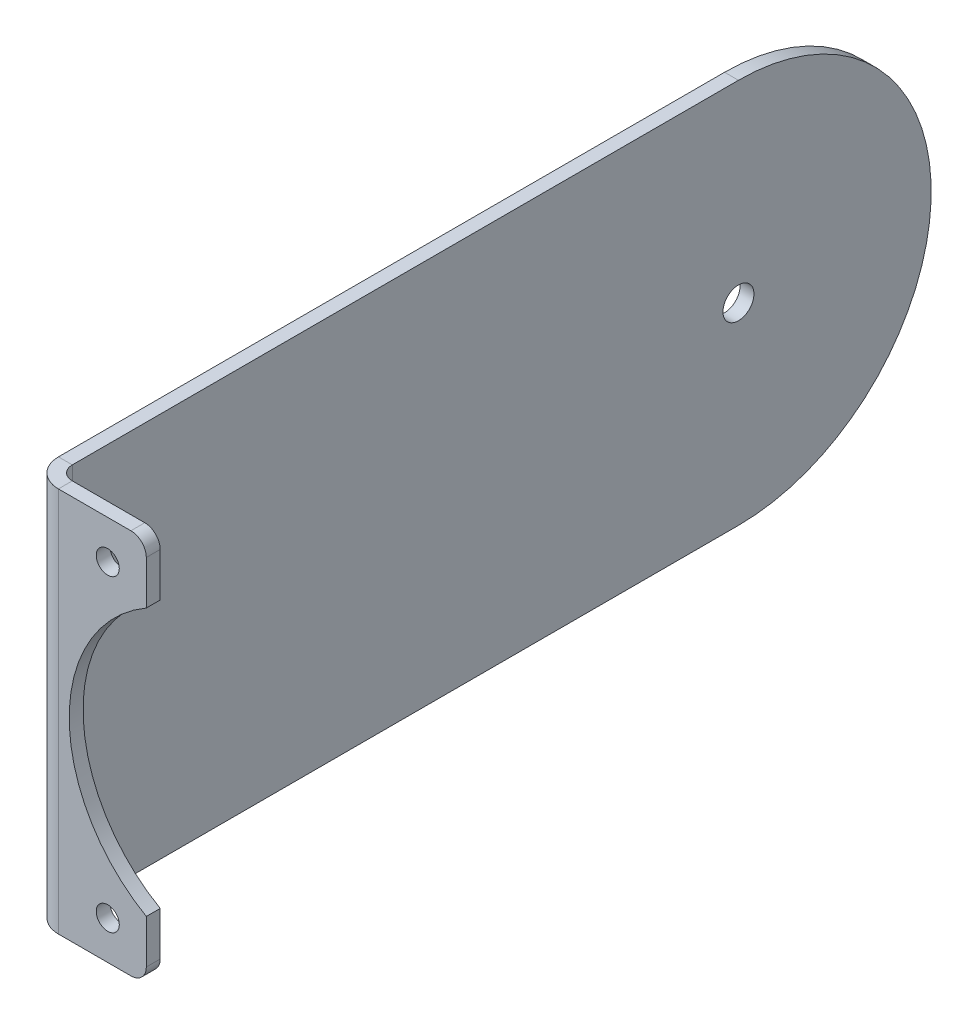
ISO-10303-21;
HEADER;
FILE_DESCRIPTION(('STEP AP214'),'2;1');
FILE_NAME('part.step','',(''),(''),'','','');
FILE_SCHEMA(('AUTOMOTIVE_DESIGN { 1 0 10303 214 1 1 1 1 }'));
ENDSEC;
DATA;
#1=APPLICATION_CONTEXT('core data for automotive mechanical design processes');
#2=APPLICATION_PROTOCOL_DEFINITION('international standard','automotive_design',2000,#1);
#3=PRODUCT_CONTEXT('',#1,'mechanical');
#4=PRODUCT('Part','Part','',(#3));
#5=PRODUCT_RELATED_PRODUCT_CATEGORY('part','',(#4));
#6=PRODUCT_DEFINITION_FORMATION('','',#4);
#7=PRODUCT_DEFINITION_CONTEXT('part definition',#1,'design');
#8=PRODUCT_DEFINITION('design','',#6,#7);
#9=PRODUCT_DEFINITION_SHAPE('','',#8);
#10=(LENGTH_UNIT() NAMED_UNIT(*) SI_UNIT(.MILLI.,.METRE.));
#11=(NAMED_UNIT(*) PLANE_ANGLE_UNIT() SI_UNIT($,.RADIAN.));
#12=(NAMED_UNIT(*) SI_UNIT($,.STERADIAN.) SOLID_ANGLE_UNIT());
#13=UNCERTAINTY_MEASURE_WITH_UNIT(LENGTH_MEASURE(1.E-05),#10,'distance_accuracy_value','');
#14=(GEOMETRIC_REPRESENTATION_CONTEXT(3) GLOBAL_UNCERTAINTY_ASSIGNED_CONTEXT((#13)) GLOBAL_UNIT_ASSIGNED_CONTEXT((#10,
#11,#12)) REPRESENTATION_CONTEXT('',''));
#15=CARTESIAN_POINT('',(0.,0.,0.));
#16=DIRECTION('',(0.,0.,1.));
#17=DIRECTION('',(1.,0.,0.));
#18=AXIS2_PLACEMENT_3D('',#15,#16,#17);
#19=CARTESIAN_POINT('',(-7.23900000000001,31.75,-73.025));
#20=DIRECTION('',(1.,0.,0.));
#21=DIRECTION('',(0.,0.,-1.));
#22=AXIS2_PLACEMENT_3D('',#19,#20,#21);
#23=PLANE('',#22);
#24=CARTESIAN_POINT('',(-7.23900000000001,0.,-41.275));
#25=DIRECTION('',(1.,0.,0.));
#26=DIRECTION('',(0.,0.,-1.));
#27=AXIS2_PLACEMENT_3D('',#24,#25,#26);
#28=CIRCLE('',#27,2.5527);
#29=CARTESIAN_POINT('',(-7.23900000000001,0.,-43.8277));
#30=VERTEX_POINT('',#29);
#31=EDGE_CURVE('E148',#30,#30,#28,.T.);
#32=ORIENTED_EDGE('',*,*,#31,.F.);
#33=EDGE_LOOP('',(#32));
#34=FACE_BOUND('',#33,.T.);
#35=DIRECTION('',(0.,0.,1.));
#36=VECTOR('',#35,1.);
#37=CARTESIAN_POINT('',(-7.23900000000001,-31.75,-73.025));
#38=LINE('',#37,#36);
#39=CARTESIAN_POINT('',(-7.23900000000001,-31.75,-41.275));
#40=VERTEX_POINT('',#39);
#41=CARTESIAN_POINT('',(-7.23900000000001,-31.75,68.453));
#42=VERTEX_POINT('',#41);
#43=EDGE_CURVE('E155',#40,#42,#38,.T.);
#44=ORIENTED_EDGE('',*,*,#43,.F.);
#45=CARTESIAN_POINT('',(-7.23900000000001,0.,-41.275));
#46=DIRECTION('',(1.,0.,0.));
#47=DIRECTION('',(0.,0.,-1.));
#48=AXIS2_PLACEMENT_3D('',#45,#46,#47);
#49=CIRCLE('',#48,31.75);
#50=CARTESIAN_POINT('',(-7.23900000000001,31.75,-41.275));
#51=VERTEX_POINT('',#50);
#52=EDGE_CURVE('E61',#51,#40,#49,.F.);
#53=ORIENTED_EDGE('',*,*,#52,.F.);
#54=DIRECTION('',(0.,0.,1.));
#55=VECTOR('',#54,1.);
#56=CARTESIAN_POINT('',(-7.23900000000001,31.75,-73.025));
#57=LINE('',#56,#55);
#58=CARTESIAN_POINT('',(-7.23900000000001,31.75,68.453));
#59=VERTEX_POINT('',#58);
#60=EDGE_CURVE('E244',#51,#59,#57,.T.);
#61=ORIENTED_EDGE('',*,*,#60,.T.);
#62=DIRECTION('',(0.,-1.,0.));
#63=VECTOR('',#62,1.);
#64=CARTESIAN_POINT('',(-7.23900000000001,31.75,68.453));
#65=LINE('',#64,#63);
#66=EDGE_CURVE('E170',#59,#42,#65,.T.);
#67=ORIENTED_EDGE('',*,*,#66,.T.);
#68=EDGE_LOOP('',(#44,#53,#61,#67));
#69=FACE_BOUND('',#68,.T.);
#70=ADVANCED_FACE('F44',(#34,#69),#23,.T.);
#71=CARTESIAN_POINT('',(-9.52500000000001,31.75,-73.025));
#72=DIRECTION('',(1.,0.,0.));
#73=DIRECTION('',(0.,0.,-1.));
#74=AXIS2_PLACEMENT_3D('',#71,#72,#73);
#75=PLANE('',#74);
#76=CARTESIAN_POINT('',(-9.52500000000001,0.,-41.275));
#77=DIRECTION('',(-1.,0.,0.));
#78=DIRECTION('',(0.,0.,1.));
#79=AXIS2_PLACEMENT_3D('',#76,#77,#78);
#80=CIRCLE('',#79,2.5527);
#81=CARTESIAN_POINT('',(-9.52500000000001,0.,-38.7223));
#82=VERTEX_POINT('',#81);
#83=EDGE_CURVE('E210',#82,#82,#80,.T.);
#84=ORIENTED_EDGE('',*,*,#83,.F.);
#85=EDGE_LOOP('',(#84));
#86=FACE_BOUND('',#85,.T.);
#87=DIRECTION('',(0.,0.,1.));
#88=VECTOR('',#87,1.);
#89=CARTESIAN_POINT('',(-9.52500000000001,31.75,-73.025));
#90=LINE('',#89,#88);
#91=CARTESIAN_POINT('',(-9.52500000000001,31.75,-41.275));
#92=VERTEX_POINT('',#91);
#93=CARTESIAN_POINT('',(-9.52500000000001,31.75,68.453));
#94=VERTEX_POINT('',#93);
#95=EDGE_CURVE('E146',#92,#94,#90,.T.);
#96=ORIENTED_EDGE('',*,*,#95,.F.);
#97=CARTESIAN_POINT('',(-9.52500000000001,0.,-41.275));
#98=DIRECTION('',(1.,0.,0.));
#99=DIRECTION('',(0.,0.,1.));
#100=AXIS2_PLACEMENT_3D('',#97,#98,#99);
#101=CIRCLE('',#100,31.75);
#102=CARTESIAN_POINT('',(-9.52500000000001,-31.75,-41.275));
#103=VERTEX_POINT('',#102);
#104=EDGE_CURVE('E135',#103,#92,#101,.T.);
#105=ORIENTED_EDGE('',*,*,#104,.F.);
#106=DIRECTION('',(0.,0.,1.));
#107=VECTOR('',#106,1.);
#108=CARTESIAN_POINT('',(-9.52500000000001,-31.75,-73.025));
#109=LINE('',#108,#107);
#110=CARTESIAN_POINT('',(-9.52500000000001,-31.75,68.453));
#111=VERTEX_POINT('',#110);
#112=EDGE_CURVE('E144',#103,#111,#109,.T.);
#113=ORIENTED_EDGE('',*,*,#112,.T.);
#114=DIRECTION('',(0.,-1.,0.));
#115=VECTOR('',#114,1.);
#116=CARTESIAN_POINT('',(-9.52500000000001,31.75,68.453));
#117=LINE('',#116,#115);
#118=EDGE_CURVE('E167',#94,#111,#117,.T.);
#119=ORIENTED_EDGE('',*,*,#118,.F.);
#120=EDGE_LOOP('',(#96,#105,#113,#119));
#121=FACE_BOUND('',#120,.T.);
#122=ADVANCED_FACE('F142',(#86,#121),#75,.F.);
#123=CARTESIAN_POINT('',(9.525,31.75,70.739));
#124=DIRECTION('',(1.,0.,0.));
#125=DIRECTION('',(0.,0.,-1.));
#126=AXIS2_PLACEMENT_3D('',#123,#124,#125);
#127=PLANE('',#126);
#128=DIRECTION('',(0.,-1.,0.));
#129=VECTOR('',#128,1.);
#130=CARTESIAN_POINT('',(9.525,31.75,70.739));
#131=LINE('',#130,#129);
#132=CARTESIAN_POINT('',(9.525,29.21,70.739));
#133=VERTEX_POINT('',#132);
#134=CARTESIAN_POINT('',(9.525,21.9970452561247,70.739));
#135=VERTEX_POINT('',#134);
#136=EDGE_CURVE('E177',#133,#135,#131,.T.);
#137=ORIENTED_EDGE('',*,*,#136,.F.);
#138=DIRECTION('',(0.,0.,1.));
#139=VECTOR('',#138,1.);
#140=CARTESIAN_POINT('',(9.525,29.21,70.739));
#141=LINE('',#140,#139);
#142=CARTESIAN_POINT('',(9.525,29.21,73.025));
#143=VERTEX_POINT('',#142);
#144=EDGE_CURVE('E193',#133,#143,#141,.T.);
#145=ORIENTED_EDGE('',*,*,#144,.T.);
#146=DIRECTION('',(0.,-1.,0.));
#147=VECTOR('',#146,1.);
#148=CARTESIAN_POINT('',(9.525,31.75,73.025));
#149=LINE('',#148,#147);
#150=CARTESIAN_POINT('',(9.525,21.9970452561247,73.025));
#151=VERTEX_POINT('',#150);
#152=EDGE_CURVE('E180',#143,#151,#149,.T.);
#153=ORIENTED_EDGE('',*,*,#152,.T.);
#154=DIRECTION('',(0.,0.,1.));
#155=VECTOR('',#154,1.);
#156=CARTESIAN_POINT('',(9.525,21.9970452561247,-73.025));
#157=LINE('',#156,#155);
#158=EDGE_CURVE('E232',#135,#151,#157,.T.);
#159=ORIENTED_EDGE('',*,*,#158,.F.);
#160=EDGE_LOOP('',(#137,#145,#153,#159));
#161=FACE_BOUND('',#160,.T.);
#162=ADVANCED_FACE('F288',(#161),#127,.T.);
#163=CARTESIAN_POINT('',(-9.52500000000001,31.75,68.453));
#164=DIRECTION('',(0.,1.,0.));
#165=DIRECTION('',(0.,0.,1.));
#166=AXIS2_PLACEMENT_3D('',#163,#164,#165);
#167=PLANE('',#166);
#168=DIRECTION('',(1.,0.,0.));
#169=VECTOR('',#168,1.);
#170=CARTESIAN_POINT('',(-9.52500000000001,31.75,68.453));
#171=LINE('',#170,#169);
#172=EDGE_CURVE('E187',#94,#59,#171,.T.);
#173=ORIENTED_EDGE('',*,*,#172,.F.);
#174=CARTESIAN_POINT('',(-4.95300000000001,31.75,68.453));
#175=DIRECTION('',(0.,-1.,0.));
#176=DIRECTION('',(0.,0.,-1.));
#177=AXIS2_PLACEMENT_3D('',#174,#175,#176);
#178=CIRCLE('',#177,4.572);
#179=CARTESIAN_POINT('',(-4.95300000000001,31.75,73.025));
#180=VERTEX_POINT('',#179);
#181=EDGE_CURVE('E168',#94,#180,#178,.F.);
#182=ORIENTED_EDGE('',*,*,#181,.T.);
#183=DIRECTION('',(0.,0.,1.));
#184=VECTOR('',#183,1.);
#185=CARTESIAN_POINT('',(-4.95300000000001,31.75,70.739));
#186=LINE('',#185,#184);
#187=CARTESIAN_POINT('',(-4.95300000000001,31.75,70.739));
#188=VERTEX_POINT('',#187);
#189=EDGE_CURVE('E185',#188,#180,#186,.T.);
#190=ORIENTED_EDGE('',*,*,#189,.F.);
#191=CARTESIAN_POINT('',(-4.95300000000001,31.75,68.453));
#192=DIRECTION('',(0.,1.,0.));
#193=DIRECTION('',(-1.,0.,0.));
#194=AXIS2_PLACEMENT_3D('',#191,#192,#193);
#195=CIRCLE('',#194,2.286);
#196=EDGE_CURVE('E241',#59,#188,#195,.T.);
#197=ORIENTED_EDGE('',*,*,#196,.F.);
#198=EDGE_LOOP('',(#173,#182,#190,#197));
#199=FACE_BOUND('',#198,.T.);
#200=ADVANCED_FACE('F299',(#199),#167,.T.);
#201=CARTESIAN_POINT('',(-4.95300000000001,31.75,70.739));
#202=DIRECTION('',(0.,1.,0.));
#203=DIRECTION('',(0.,0.,1.));
#204=AXIS2_PLACEMENT_3D('',#201,#202,#203);
#205=PLANE('',#204);
#206=DIRECTION('',(-1.,0.,0.));
#207=VECTOR('',#206,1.);
#208=CARTESIAN_POINT('',(9.52499999999999,31.75,-41.275));
#209=LINE('',#208,#207);
#210=EDGE_CURVE('E147',#51,#92,#209,.T.);
#211=ORIENTED_EDGE('',*,*,#210,.T.);
#212=ORIENTED_EDGE('',*,*,#95,.T.);
#213=ORIENTED_EDGE('',*,*,#172,.T.);
#214=ORIENTED_EDGE('',*,*,#60,.F.);
#215=EDGE_LOOP('',(#211,#212,#213,#214));
#216=FACE_BOUND('',#215,.T.);
#217=ADVANCED_FACE('F336',(#216),#205,.T.);
#218=CARTESIAN_POINT('',(-4.95300000000001,-31.75,73.025));
#219=DIRECTION('',(0.,-1.,0.));
#220=DIRECTION('',(0.,0.,-1.));
#221=AXIS2_PLACEMENT_3D('',#218,#219,#220);
#222=PLANE('',#221);
#223=DIRECTION('',(0.,0.,-1.));
#224=VECTOR('',#223,1.);
#225=CARTESIAN_POINT('',(-4.95300000000001,-31.75,73.025));
#226=LINE('',#225,#224);
#227=CARTESIAN_POINT('',(-4.95300000000001,-31.75,73.025));
#228=VERTEX_POINT('',#227);
#229=CARTESIAN_POINT('',(-4.95300000000001,-31.75,70.739));
#230=VERTEX_POINT('',#229);
#231=EDGE_CURVE('E183',#228,#230,#226,.T.);
#232=ORIENTED_EDGE('',*,*,#231,.F.);
#233=CARTESIAN_POINT('',(-4.95300000000001,-31.75,68.453));
#234=DIRECTION('',(0.,-1.,0.));
#235=DIRECTION('',(0.,0.,-1.));
#236=AXIS2_PLACEMENT_3D('',#233,#234,#235);
#237=CIRCLE('',#236,4.572);
#238=EDGE_CURVE('E154',#111,#228,#237,.F.);
#239=ORIENTED_EDGE('',*,*,#238,.F.);
#240=DIRECTION('',(-1.,0.,0.));
#241=VECTOR('',#240,1.);
#242=CARTESIAN_POINT('',(-7.23900000000001,-31.75,68.453));
#243=LINE('',#242,#241);
#244=EDGE_CURVE('E152',#42,#111,#243,.T.);
#245=ORIENTED_EDGE('',*,*,#244,.F.);
#246=CARTESIAN_POINT('',(-4.95300000000001,-31.75,68.453));
#247=DIRECTION('',(0.,1.,0.));
#248=DIRECTION('',(-1.,0.,0.));
#249=AXIS2_PLACEMENT_3D('',#246,#247,#248);
#250=CIRCLE('',#249,2.286);
#251=EDGE_CURVE('E160',#42,#230,#250,.T.);
#252=ORIENTED_EDGE('',*,*,#251,.T.);
#253=EDGE_LOOP('',(#232,#239,#245,#252));
#254=FACE_BOUND('',#253,.T.);
#255=ADVANCED_FACE('F255',(#254),#222,.T.);
#256=CARTESIAN_POINT('',(-7.23900000000001,-31.75,68.453));
#257=DIRECTION('',(0.,-1.,0.));
#258=DIRECTION('',(0.,0.,-1.));
#259=AXIS2_PLACEMENT_3D('',#256,#257,#258);
#260=PLANE('',#259);
#261=DIRECTION('',(-1.,0.,0.));
#262=VECTOR('',#261,1.);
#263=CARTESIAN_POINT('',(-9.52500000000001,-31.75,70.739));
#264=LINE('',#263,#262);
#265=CARTESIAN_POINT('',(6.98499999999999,-31.75,70.739));
#266=VERTEX_POINT('',#265);
#267=EDGE_CURVE('E251',#230,#266,#264,.F.);
#268=ORIENTED_EDGE('',*,*,#267,.T.);
#269=DIRECTION('',(0.,0.,1.));
#270=VECTOR('',#269,1.);
#271=CARTESIAN_POINT('',(6.98499999999999,-31.75,68.453));
#272=LINE('',#271,#270);
#273=CARTESIAN_POINT('',(6.98499999999999,-31.75,73.025));
#274=VERTEX_POINT('',#273);
#275=EDGE_CURVE('E205',#266,#274,#272,.T.);
#276=ORIENTED_EDGE('',*,*,#275,.T.);
#277=DIRECTION('',(1.,0.,0.));
#278=VECTOR('',#277,1.);
#279=CARTESIAN_POINT('',(-9.52500000000001,-31.75,73.025));
#280=LINE('',#279,#278);
#281=EDGE_CURVE('E235',#228,#274,#280,.T.);
#282=ORIENTED_EDGE('',*,*,#281,.F.);
#283=ORIENTED_EDGE('',*,*,#231,.T.);
#284=EDGE_LOOP('',(#268,#276,#282,#283));
#285=FACE_BOUND('',#284,.T.);
#286=ADVANCED_FACE('F266',(#285),#260,.T.);
#287=CARTESIAN_POINT('',(-9.52500000000001,31.75,73.025));
#288=DIRECTION('',(0.,0.,-1.));
#289=DIRECTION('',(-1.,0.,0.));
#290=AXIS2_PLACEMENT_3D('',#287,#288,#289);
#291=PLANE('',#290);
#292=CARTESIAN_POINT('',(3.17499999999999,25.4,73.025));
#293=DIRECTION('',(0.,0.,1.));
#294=DIRECTION('',(1.,0.,0.));
#295=AXIS2_PLACEMENT_3D('',#292,#293,#294);
#296=CIRCLE('',#295,1.89865);
#297=CARTESIAN_POINT('',(5.07364999999999,25.4,73.025));
#298=VERTEX_POINT('',#297);
#299=EDGE_CURVE('E221',#298,#298,#296,.T.);
#300=ORIENTED_EDGE('',*,*,#299,.F.);
#301=EDGE_LOOP('',(#300));
#302=FACE_BOUND('',#301,.T.);
#303=CARTESIAN_POINT('',(3.17499999999999,-25.4,73.025));
#304=DIRECTION('',(0.,0.,1.));
#305=DIRECTION('',(1.,0.,0.));
#306=AXIS2_PLACEMENT_3D('',#303,#304,#305);
#307=CIRCLE('',#306,1.89865);
#308=CARTESIAN_POINT('',(5.07364999999999,-25.4,73.025));
#309=VERTEX_POINT('',#308);
#310=EDGE_CURVE('E211',#309,#309,#307,.T.);
#311=ORIENTED_EDGE('',*,*,#310,.F.);
#312=EDGE_LOOP('',(#311));
#313=FACE_BOUND('',#312,.T.);
#314=ORIENTED_EDGE('',*,*,#152,.F.);
#315=CARTESIAN_POINT('',(6.98499999999999,29.21,73.025));
#316=DIRECTION('',(0.,0.,-1.));
#317=DIRECTION('',(-1.,0.,0.));
#318=AXIS2_PLACEMENT_3D('',#315,#316,#317);
#319=CIRCLE('',#318,2.54);
#320=CARTESIAN_POINT('',(6.98499999999999,31.75,73.025));
#321=VERTEX_POINT('',#320);
#322=EDGE_CURVE('E198',#143,#321,#319,.F.);
#323=ORIENTED_EDGE('',*,*,#322,.T.);
#324=DIRECTION('',(1.,0.,0.));
#325=VECTOR('',#324,1.);
#326=CARTESIAN_POINT('',(-9.52500000000001,31.75,73.025));
#327=LINE('',#326,#325);
#328=EDGE_CURVE('E158',#180,#321,#327,.T.);
#329=ORIENTED_EDGE('',*,*,#328,.F.);
#330=DIRECTION('',(0.,-1.,0.));
#331=VECTOR('',#330,1.);
#332=CARTESIAN_POINT('',(-4.95300000000001,31.75,73.025));
#333=LINE('',#332,#331);
#334=EDGE_CURVE('E164',#180,#228,#333,.T.);
#335=ORIENTED_EDGE('',*,*,#334,.T.);
#336=ORIENTED_EDGE('',*,*,#281,.T.);
#337=CARTESIAN_POINT('',(6.98499999999999,-29.21,73.025));
#338=DIRECTION('',(0.,0.,-1.));
#339=DIRECTION('',(-1.,0.,0.));
#340=AXIS2_PLACEMENT_3D('',#337,#338,#339);
#341=CIRCLE('',#340,2.54);
#342=CARTESIAN_POINT('',(9.525,-29.21,73.025));
#343=VERTEX_POINT('',#342);
#344=EDGE_CURVE('E196',#274,#343,#341,.F.);
#345=ORIENTED_EDGE('',*,*,#344,.T.);
#346=CARTESIAN_POINT('',(9.525,-21.9970452561247,73.025));
#347=VERTEX_POINT('',#346);
#348=EDGE_CURVE('E179',#347,#343,#149,.T.);
#349=ORIENTED_EDGE('',*,*,#348,.F.);
#350=CARTESIAN_POINT('',(22.225,0.,73.025));
#351=DIRECTION('',(0.,0.,1.));
#352=DIRECTION('',(1.,0.,0.));
#353=AXIS2_PLACEMENT_3D('',#350,#351,#352);
#354=CIRCLE('',#353,25.4);
#355=EDGE_CURVE('E228',#151,#347,#354,.T.);
#356=ORIENTED_EDGE('',*,*,#355,.F.);
#357=EDGE_LOOP('',(#314,#323,#329,#335,#336,#345,#349,#356));
#358=FACE_BOUND('',#357,.T.);
#359=ADVANCED_FACE('F274',(#302,#313,#358),#291,.F.);
#360=ORIENTED_EDGE('',*,*,#348,.T.);
#361=DIRECTION('',(0.,0.,1.));
#362=VECTOR('',#361,1.);
#363=CARTESIAN_POINT('',(9.525,-29.21,70.739));
#364=LINE('',#363,#362);
#365=CARTESIAN_POINT('',(9.525,-29.21,70.739));
#366=VERTEX_POINT('',#365);
#367=EDGE_CURVE('E53',#343,#366,#364,.F.);
#368=ORIENTED_EDGE('',*,*,#367,.T.);
#369=CARTESIAN_POINT('',(9.525,-21.9970452561247,70.739));
#370=VERTEX_POINT('',#369);
#371=EDGE_CURVE('E176',#370,#366,#131,.T.);
#372=ORIENTED_EDGE('',*,*,#371,.F.);
#373=DIRECTION('',(0.,0.,1.));
#374=VECTOR('',#373,1.);
#375=CARTESIAN_POINT('',(9.525,-21.9970452561247,-73.025));
#376=LINE('',#375,#374);
#377=EDGE_CURVE('E230',#347,#370,#376,.F.);
#378=ORIENTED_EDGE('',*,*,#377,.F.);
#379=EDGE_LOOP('',(#360,#368,#372,#378));
#380=FACE_BOUND('',#379,.T.);
#381=ADVANCED_FACE('F278',(#380),#127,.T.);
#382=CARTESIAN_POINT('',(-9.52500000000001,31.75,70.739));
#383=DIRECTION('',(0.,0.,-1.));
#384=DIRECTION('',(-1.,0.,0.));
#385=AXIS2_PLACEMENT_3D('',#382,#383,#384);
#386=PLANE('',#385);
#387=CARTESIAN_POINT('',(3.17499999999999,25.4,70.739));
#388=DIRECTION('',(0.,0.,-1.));
#389=DIRECTION('',(-1.,0.,0.));
#390=AXIS2_PLACEMENT_3D('',#387,#388,#389);
#391=CIRCLE('',#390,1.89864999999998);
#392=CARTESIAN_POINT('',(1.27635000000001,25.4,70.739));
#393=VERTEX_POINT('',#392);
#394=EDGE_CURVE('E48',#393,#393,#391,.T.);
#395=ORIENTED_EDGE('',*,*,#394,.F.);
#396=EDGE_LOOP('',(#395));
#397=FACE_BOUND('',#396,.T.);
#398=CARTESIAN_POINT('',(3.17499999999999,-25.4,70.739));
#399=DIRECTION('',(0.,0.,-1.));
#400=DIRECTION('',(-1.,0.,0.));
#401=AXIS2_PLACEMENT_3D('',#398,#399,#400);
#402=CIRCLE('',#401,1.89864999999998);
#403=CARTESIAN_POINT('',(1.27635000000001,-25.4,70.739));
#404=VERTEX_POINT('',#403);
#405=EDGE_CURVE('E208',#404,#404,#402,.T.);
#406=ORIENTED_EDGE('',*,*,#405,.F.);
#407=EDGE_LOOP('',(#406));
#408=FACE_BOUND('',#407,.T.);
#409=DIRECTION('',(-1.,0.,0.));
#410=VECTOR('',#409,1.);
#411=CARTESIAN_POINT('',(-9.52500000000001,31.75,70.739));
#412=LINE('',#411,#410);
#413=CARTESIAN_POINT('',(6.98499999999999,31.75,70.739));
#414=VERTEX_POINT('',#413);
#415=EDGE_CURVE('E238',#188,#414,#412,.F.);
#416=ORIENTED_EDGE('',*,*,#415,.T.);
#417=CARTESIAN_POINT('',(6.98499999999999,29.21,70.739));
#418=DIRECTION('',(0.,0.,-1.));
#419=DIRECTION('',(-1.,0.,0.));
#420=AXIS2_PLACEMENT_3D('',#417,#418,#419);
#421=CIRCLE('',#420,2.54);
#422=EDGE_CURVE('E203',#414,#133,#421,.T.);
#423=ORIENTED_EDGE('',*,*,#422,.T.);
#424=ORIENTED_EDGE('',*,*,#136,.T.);
#425=CARTESIAN_POINT('',(22.225,0.,70.739));
#426=DIRECTION('',(0.,0.,-1.));
#427=DIRECTION('',(-1.,0.,0.));
#428=AXIS2_PLACEMENT_3D('',#425,#426,#427);
#429=CIRCLE('',#428,25.4);
#430=EDGE_CURVE('E190',#370,#135,#429,.T.);
#431=ORIENTED_EDGE('',*,*,#430,.F.);
#432=ORIENTED_EDGE('',*,*,#371,.T.);
#433=CARTESIAN_POINT('',(6.98499999999999,-29.21,70.739));
#434=DIRECTION('',(0.,0.,-1.));
#435=DIRECTION('',(-1.,0.,0.));
#436=AXIS2_PLACEMENT_3D('',#433,#434,#435);
#437=CIRCLE('',#436,2.54);
#438=EDGE_CURVE('E68',#366,#266,#437,.T.);
#439=ORIENTED_EDGE('',*,*,#438,.T.);
#440=ORIENTED_EDGE('',*,*,#267,.F.);
#441=DIRECTION('',(0.,-1.,0.));
#442=VECTOR('',#441,1.);
#443=CARTESIAN_POINT('',(-4.95300000000001,31.75,70.739));
#444=LINE('',#443,#442);
#445=EDGE_CURVE('E173',#188,#230,#444,.T.);
#446=ORIENTED_EDGE('',*,*,#445,.F.);
#447=EDGE_LOOP('',(#416,#423,#424,#431,#432,#439,#440,#446));
#448=FACE_BOUND('',#447,.T.);
#449=ADVANCED_FACE('F263',(#397,#408,#448),#386,.T.);
#450=CARTESIAN_POINT('',(-4.95300000000001,31.75,68.453));
#451=DIRECTION('',(0.,-1.,0.));
#452=DIRECTION('',(0.,0.,-1.));
#453=AXIS2_PLACEMENT_3D('',#450,#451,#452);
#454=CYLINDRICAL_SURFACE('',#453,2.286);
#455=ORIENTED_EDGE('',*,*,#251,.F.);
#456=ORIENTED_EDGE('',*,*,#66,.F.);
#457=ORIENTED_EDGE('',*,*,#196,.T.);
#458=ORIENTED_EDGE('',*,*,#445,.T.);
#459=EDGE_LOOP('',(#455,#456,#457,#458));
#460=FACE_BOUND('',#459,.T.);
#461=ADVANCED_FACE('F259',(#460),#454,.F.);
#462=CARTESIAN_POINT('',(-4.95300000000001,31.75,68.453));
#463=DIRECTION('',(0.,-1.,0.));
#464=DIRECTION('',(0.,0.,-1.));
#465=AXIS2_PLACEMENT_3D('',#462,#463,#464);
#466=CYLINDRICAL_SURFACE('',#465,4.572);
#467=ORIENTED_EDGE('',*,*,#238,.T.);
#468=ORIENTED_EDGE('',*,*,#334,.F.);
#469=ORIENTED_EDGE('',*,*,#181,.F.);
#470=ORIENTED_EDGE('',*,*,#118,.T.);
#471=EDGE_LOOP('',(#467,#468,#469,#470));
#472=FACE_BOUND('',#471,.T.);
#473=ADVANCED_FACE('F301',(#472),#466,.T.);
#474=CARTESIAN_POINT('',(-4.95300000000001,31.75,68.453));
#475=DIRECTION('',(0.,1.,0.));
#476=DIRECTION('',(-1.,0.,0.));
#477=AXIS2_PLACEMENT_3D('',#474,#475,#476);
#478=PLANE('',#477);
#479=ORIENTED_EDGE('',*,*,#328,.T.);
#480=DIRECTION('',(0.,0.,1.));
#481=VECTOR('',#480,1.);
#482=CARTESIAN_POINT('',(6.98499999999999,31.75,68.453));
#483=LINE('',#482,#481);
#484=EDGE_CURVE('E200',#321,#414,#483,.F.);
#485=ORIENTED_EDGE('',*,*,#484,.T.);
#486=ORIENTED_EDGE('',*,*,#415,.F.);
#487=ORIENTED_EDGE('',*,*,#189,.T.);
#488=EDGE_LOOP('',(#479,#485,#486,#487));
#489=FACE_BOUND('',#488,.T.);
#490=ADVANCED_FACE('F294',(#489),#478,.T.);
#491=CARTESIAN_POINT('',(-4.95300000000001,-31.75,68.453));
#492=DIRECTION('',(0.,1.,0.));
#493=DIRECTION('',(-1.,0.,0.));
#494=AXIS2_PLACEMENT_3D('',#491,#492,#493);
#495=PLANE('',#494);
#496=ORIENTED_EDGE('',*,*,#112,.F.);
#497=DIRECTION('',(-1.,0.,0.));
#498=VECTOR('',#497,1.);
#499=CARTESIAN_POINT('',(9.52499999999999,-31.75,-41.275));
#500=LINE('',#499,#498);
#501=EDGE_CURVE('E11',#103,#40,#500,.F.);
#502=ORIENTED_EDGE('',*,*,#501,.T.);
#503=ORIENTED_EDGE('',*,*,#43,.T.);
#504=ORIENTED_EDGE('',*,*,#244,.T.);
#505=EDGE_LOOP('',(#496,#502,#503,#504));
#506=FACE_BOUND('',#505,.T.);
#507=ADVANCED_FACE('F150',(#506),#495,.F.);
#508=CARTESIAN_POINT('',(22.225,0.,-73.025));
#509=DIRECTION('',(0.,0.,1.));
#510=DIRECTION('',(1.,0.,0.));
#511=AXIS2_PLACEMENT_3D('',#508,#509,#510);
#512=CYLINDRICAL_SURFACE('',#511,25.4);
#513=ORIENTED_EDGE('',*,*,#158,.T.);
#514=ORIENTED_EDGE('',*,*,#355,.T.);
#515=ORIENTED_EDGE('',*,*,#377,.T.);
#516=ORIENTED_EDGE('',*,*,#430,.T.);
#517=EDGE_LOOP('',(#513,#514,#515,#516));
#518=FACE_BOUND('',#517,.T.);
#519=ADVANCED_FACE('F282',(#518),#512,.F.);
#520=CARTESIAN_POINT('',(6.98499999999999,29.21,70.739));
#521=DIRECTION('',(0.,0.,1.));
#522=DIRECTION('',(1.,0.,0.));
#523=AXIS2_PLACEMENT_3D('',#520,#521,#522);
#524=CYLINDRICAL_SURFACE('',#523,2.54);
#525=ORIENTED_EDGE('',*,*,#422,.F.);
#526=ORIENTED_EDGE('',*,*,#484,.F.);
#527=ORIENTED_EDGE('',*,*,#322,.F.);
#528=ORIENTED_EDGE('',*,*,#144,.F.);
#529=EDGE_LOOP('',(#525,#526,#527,#528));
#530=FACE_BOUND('',#529,.T.);
#531=ADVANCED_FACE('F290',(#530),#524,.T.);
#532=CARTESIAN_POINT('',(6.98499999999999,-29.21,68.453));
#533=DIRECTION('',(0.,0.,1.));
#534=DIRECTION('',(1.,0.,0.));
#535=AXIS2_PLACEMENT_3D('',#532,#533,#534);
#536=CYLINDRICAL_SURFACE('',#535,2.54);
#537=ORIENTED_EDGE('',*,*,#438,.F.);
#538=ORIENTED_EDGE('',*,*,#367,.F.);
#539=ORIENTED_EDGE('',*,*,#344,.F.);
#540=ORIENTED_EDGE('',*,*,#275,.F.);
#541=EDGE_LOOP('',(#537,#538,#539,#540));
#542=FACE_BOUND('',#541,.T.);
#543=ADVANCED_FACE('F46',(#542),#536,.T.);
#544=CARTESIAN_POINT('',(9.52499999999999,0.,-41.275));
#545=DIRECTION('',(-1.,0.,0.));
#546=DIRECTION('',(0.,0.,1.));
#547=AXIS2_PLACEMENT_3D('',#544,#545,#546);
#548=CYLINDRICAL_SURFACE('',#547,31.75);
#549=ORIENTED_EDGE('',*,*,#52,.T.);
#550=ORIENTED_EDGE('',*,*,#501,.F.);
#551=ORIENTED_EDGE('',*,*,#104,.T.);
#552=ORIENTED_EDGE('',*,*,#210,.F.);
#553=EDGE_LOOP('',(#549,#550,#551,#552));
#554=FACE_BOUND('',#553,.T.);
#555=ADVANCED_FACE('F134',(#554),#548,.T.);
#556=CARTESIAN_POINT('',(-9.52500000000001,0.,-41.275));
#557=DIRECTION('',(-1.,0.,0.));
#558=DIRECTION('',(0.,0.,1.));
#559=AXIS2_PLACEMENT_3D('',#556,#557,#558);
#560=CYLINDRICAL_SURFACE('',#559,2.5527);
#561=ORIENTED_EDGE('',*,*,#31,.T.);
#562=EDGE_LOOP('',(#561));
#563=FACE_BOUND('',#562,.T.);
#564=ORIENTED_EDGE('',*,*,#83,.T.);
#565=EDGE_LOOP('',(#564));
#566=FACE_BOUND('',#565,.T.);
#567=ADVANCED_FACE('F352',(#563,#566),#560,.F.);
#568=CARTESIAN_POINT('',(3.17499999999999,-25.4,73.025));
#569=DIRECTION('',(0.,0.,1.));
#570=DIRECTION('',(1.,0.,0.));
#571=AXIS2_PLACEMENT_3D('',#568,#569,#570);
#572=CYLINDRICAL_SURFACE('',#571,1.89864999999998);
#573=ORIENTED_EDGE('',*,*,#405,.T.);
#574=EDGE_LOOP('',(#573));
#575=FACE_BOUND('',#574,.T.);
#576=ORIENTED_EDGE('',*,*,#310,.T.);
#577=EDGE_LOOP('',(#576));
#578=FACE_BOUND('',#577,.T.);
#579=ADVANCED_FACE('F355',(#575,#578),#572,.F.);
#580=CARTESIAN_POINT('',(3.17499999999999,25.4,73.025));
#581=DIRECTION('',(0.,0.,1.));
#582=DIRECTION('',(1.,0.,0.));
#583=AXIS2_PLACEMENT_3D('',#580,#581,#582);
#584=CYLINDRICAL_SURFACE('',#583,1.89864999999998);
#585=ORIENTED_EDGE('',*,*,#394,.T.);
#586=EDGE_LOOP('',(#585));
#587=FACE_BOUND('',#586,.T.);
#588=ORIENTED_EDGE('',*,*,#299,.T.);
#589=EDGE_LOOP('',(#588));
#590=FACE_BOUND('',#589,.T.);
#591=ADVANCED_FACE('F359',(#587,#590),#584,.F.);
#592=CLOSED_SHELL('',(#70,#122,#162,#200,#217,#255,#286,#359,#381,#449,#461,#473,#490,#507,#519,
#531,#543,#555,#567,#579,#591));
#593=MANIFOLD_SOLID_BREP('B2',#592);
#594=ADVANCED_BREP_SHAPE_REPRESENTATION('',(#18,#593),#14);
#595=SHAPE_DEFINITION_REPRESENTATION(#9,#594);
ENDSEC;
END-ISO-10303-21;
